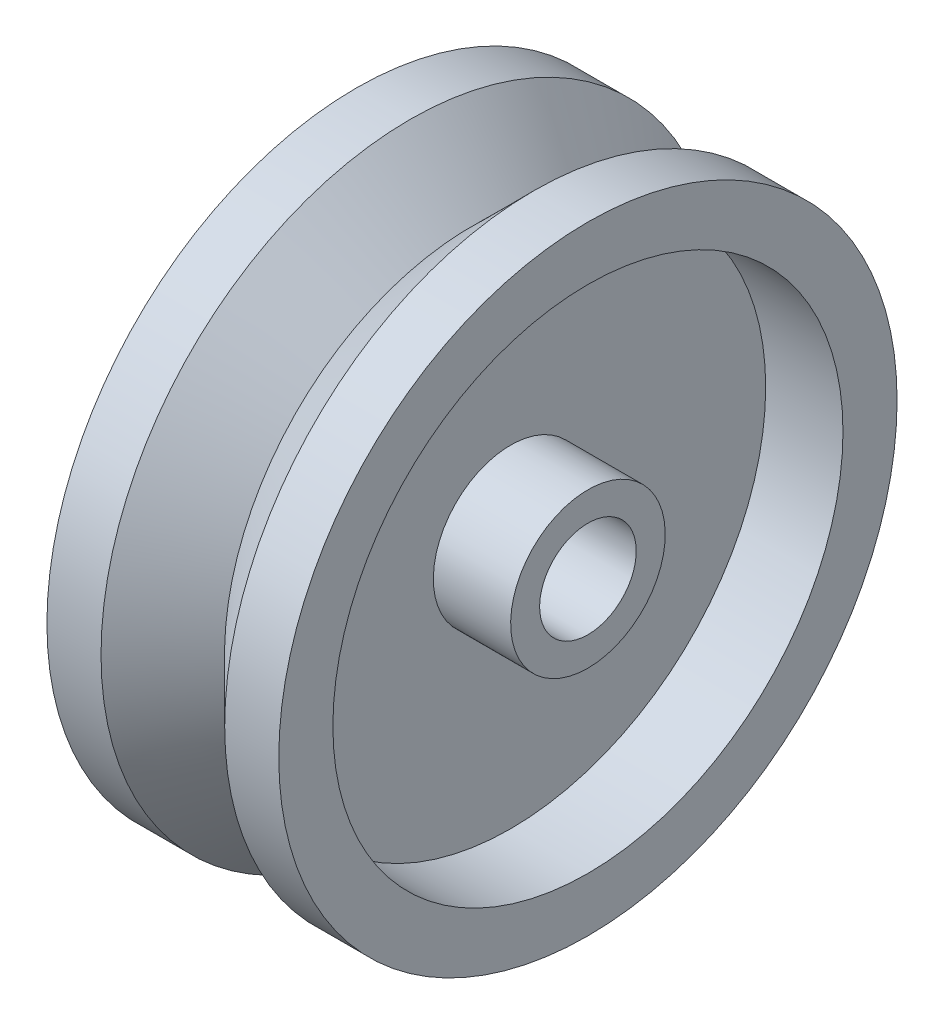
ISO-10303-21;
HEADER;
FILE_DESCRIPTION(('STEP AP214'),'2;1');
FILE_NAME('part.step','',(''),(''),'','','');
FILE_SCHEMA(('AUTOMOTIVE_DESIGN { 1 0 10303 214 1 1 1 1 }'));
ENDSEC;
DATA;
#1=APPLICATION_CONTEXT('core data for automotive mechanical design processes');
#2=APPLICATION_PROTOCOL_DEFINITION('international standard','automotive_design',2000,#1);
#3=PRODUCT_CONTEXT('',#1,'mechanical');
#4=PRODUCT('Part','Part','',(#3));
#5=PRODUCT_RELATED_PRODUCT_CATEGORY('part','',(#4));
#6=PRODUCT_DEFINITION_FORMATION('','',#4);
#7=PRODUCT_DEFINITION_CONTEXT('part definition',#1,'design');
#8=PRODUCT_DEFINITION('design','',#6,#7);
#9=PRODUCT_DEFINITION_SHAPE('','',#8);
#10=(LENGTH_UNIT() NAMED_UNIT(*) SI_UNIT(.MILLI.,.METRE.));
#11=(NAMED_UNIT(*) PLANE_ANGLE_UNIT() SI_UNIT($,.RADIAN.));
#12=(NAMED_UNIT(*) SI_UNIT($,.STERADIAN.) SOLID_ANGLE_UNIT());
#13=UNCERTAINTY_MEASURE_WITH_UNIT(LENGTH_MEASURE(1.E-05),#10,'distance_accuracy_value','');
#14=(GEOMETRIC_REPRESENTATION_CONTEXT(3) GLOBAL_UNCERTAINTY_ASSIGNED_CONTEXT((#13)) GLOBAL_UNIT_ASSIGNED_CONTEXT((#10,
#11,#12)) REPRESENTATION_CONTEXT('',''));
#15=CARTESIAN_POINT('',(0.,0.,0.));
#16=DIRECTION('',(0.,0.,1.));
#17=DIRECTION('',(1.,0.,0.));
#18=AXIS2_PLACEMENT_3D('',#15,#16,#17);
#19=CARTESIAN_POINT('',(7.5,-3.125,0.));
#20=DIRECTION('',(-1.,0.,0.));
#21=DIRECTION('',(0.,-1.,0.));
#22=AXIS2_PLACEMENT_3D('',#19,#20,#21);
#23=PLANE('',#22);
#24=CARTESIAN_POINT('',(7.5,0.,0.));
#25=DIRECTION('',(-1.,0.,0.));
#26=DIRECTION('',(0.,-1.,0.));
#27=AXIS2_PLACEMENT_3D('',#24,#25,#26);
#28=CIRCLE('',#27,5.);
#29=CARTESIAN_POINT('',(7.5,-5.,0.));
#30=VERTEX_POINT('',#29);
#31=EDGE_CURVE('E80',#30,#30,#28,.T.);
#32=ORIENTED_EDGE('',*,*,#31,.F.);
#33=EDGE_LOOP('',(#32));
#34=FACE_BOUND('',#33,.T.);
#35=CARTESIAN_POINT('',(7.5,0.,0.));
#36=DIRECTION('',(-1.,0.,0.));
#37=DIRECTION('',(0.,-1.,0.));
#38=AXIS2_PLACEMENT_3D('',#35,#36,#37);
#39=CIRCLE('',#38,3.125);
#40=CARTESIAN_POINT('',(7.5,-3.125,0.));
#41=VERTEX_POINT('',#40);
#42=EDGE_CURVE('E10',#41,#41,#39,.T.);
#43=ORIENTED_EDGE('',*,*,#42,.T.);
#44=EDGE_LOOP('',(#43));
#45=FACE_BOUND('',#44,.T.);
#46=ADVANCED_FACE('F31',(#34,#45),#23,.F.);
#47=CARTESIAN_POINT('',(-7.5,0.,0.));
#48=DIRECTION('',(-1.,0.,0.));
#49=DIRECTION('',(0.,-1.,0.));
#50=AXIS2_PLACEMENT_3D('',#47,#48,#49);
#51=CYLINDRICAL_SURFACE('',#50,3.125);
#52=ORIENTED_EDGE('',*,*,#42,.F.);
#53=EDGE_LOOP('',(#52));
#54=FACE_BOUND('',#53,.T.);
#55=CARTESIAN_POINT('',(-7.5,0.,0.));
#56=DIRECTION('',(-1.,0.,0.));
#57=DIRECTION('',(0.,-1.,0.));
#58=AXIS2_PLACEMENT_3D('',#55,#56,#57);
#59=CIRCLE('',#58,3.125);
#60=CARTESIAN_POINT('',(-7.5,-3.125,0.));
#61=VERTEX_POINT('',#60);
#62=EDGE_CURVE('E37',#61,#61,#59,.T.);
#63=ORIENTED_EDGE('',*,*,#62,.T.);
#64=EDGE_LOOP('',(#63));
#65=FACE_BOUND('',#64,.T.);
#66=ADVANCED_FACE('F87',(#54,#65),#51,.F.);
#67=CARTESIAN_POINT('',(-7.5,-3.125,0.));
#68=DIRECTION('',(1.,0.,0.));
#69=DIRECTION('',(0.,1.,0.));
#70=AXIS2_PLACEMENT_3D('',#67,#68,#69);
#71=PLANE('',#70);
#72=ORIENTED_EDGE('',*,*,#62,.F.);
#73=EDGE_LOOP('',(#72));
#74=FACE_BOUND('',#73,.T.);
#75=CARTESIAN_POINT('',(-7.5,0.,0.));
#76=DIRECTION('',(-1.,0.,0.));
#77=DIRECTION('',(0.,-1.,0.));
#78=AXIS2_PLACEMENT_3D('',#75,#76,#77);
#79=CIRCLE('',#78,5.);
#80=CARTESIAN_POINT('',(-7.5,-5.,0.));
#81=VERTEX_POINT('',#80);
#82=EDGE_CURVE('E41',#81,#81,#79,.T.);
#83=ORIENTED_EDGE('',*,*,#82,.T.);
#84=EDGE_LOOP('',(#83));
#85=FACE_BOUND('',#84,.T.);
#86=ADVANCED_FACE('F91',(#74,#85),#71,.F.);
#87=CARTESIAN_POINT('',(-7.5,0.,0.));
#88=DIRECTION('',(-1.,0.,0.));
#89=DIRECTION('',(0.,-1.,0.));
#90=AXIS2_PLACEMENT_3D('',#87,#88,#89);
#91=CYLINDRICAL_SURFACE('',#90,5.);
#92=ORIENTED_EDGE('',*,*,#82,.F.);
#93=EDGE_LOOP('',(#92));
#94=FACE_BOUND('',#93,.T.);
#95=CARTESIAN_POINT('',(-2.5,0.,0.));
#96=DIRECTION('',(-1.,0.,0.));
#97=DIRECTION('',(0.,-1.,0.));
#98=AXIS2_PLACEMENT_3D('',#95,#96,#97);
#99=CIRCLE('',#98,5.);
#100=CARTESIAN_POINT('',(-2.5,-5.,0.));
#101=VERTEX_POINT('',#100);
#102=EDGE_CURVE('E45',#101,#101,#99,.T.);
#103=ORIENTED_EDGE('',*,*,#102,.T.);
#104=EDGE_LOOP('',(#103));
#105=FACE_BOUND('',#104,.T.);
#106=ADVANCED_FACE('F96',(#94,#105),#91,.T.);
#107=CARTESIAN_POINT('',(-2.5,-5.,0.));
#108=DIRECTION('',(1.,0.,0.));
#109=DIRECTION('',(0.,1.,0.));
#110=AXIS2_PLACEMENT_3D('',#107,#108,#109);
#111=PLANE('',#110);
#112=ORIENTED_EDGE('',*,*,#102,.F.);
#113=EDGE_LOOP('',(#112));
#114=FACE_BOUND('',#113,.T.);
#115=CARTESIAN_POINT('',(-2.5,0.,0.));
#116=DIRECTION('',(-1.,0.,0.));
#117=DIRECTION('',(0.,-1.,0.));
#118=AXIS2_PLACEMENT_3D('',#115,#116,#117);
#119=CIRCLE('',#118,16.5);
#120=CARTESIAN_POINT('',(-2.49999999999999,-16.5,0.));
#121=VERTEX_POINT('',#120);
#122=EDGE_CURVE('E50',#121,#121,#119,.T.);
#123=ORIENTED_EDGE('',*,*,#122,.T.);
#124=EDGE_LOOP('',(#123));
#125=FACE_BOUND('',#124,.T.);
#126=ADVANCED_FACE('F102',(#114,#125),#111,.F.);
#127=CARTESIAN_POINT('',(-7.5,0.,0.));
#128=DIRECTION('',(-1.,0.,0.));
#129=DIRECTION('',(0.,-1.,0.));
#130=AXIS2_PLACEMENT_3D('',#127,#128,#129);
#131=CYLINDRICAL_SURFACE('',#130,16.5);
#132=ORIENTED_EDGE('',*,*,#122,.F.);
#133=EDGE_LOOP('',(#132));
#134=FACE_BOUND('',#133,.T.);
#135=CARTESIAN_POINT('',(-7.5,0.,0.));
#136=DIRECTION('',(-1.,0.,0.));
#137=DIRECTION('',(0.,-1.,0.));
#138=AXIS2_PLACEMENT_3D('',#135,#136,#137);
#139=CIRCLE('',#138,16.5);
#140=CARTESIAN_POINT('',(-7.49999999999999,-16.5,0.));
#141=VERTEX_POINT('',#140);
#142=EDGE_CURVE('E53',#141,#141,#139,.T.);
#143=ORIENTED_EDGE('',*,*,#142,.T.);
#144=EDGE_LOOP('',(#143));
#145=FACE_BOUND('',#144,.T.);
#146=ADVANCED_FACE('F106',(#134,#145),#131,.F.);
#147=CARTESIAN_POINT('',(-7.49999999999999,-16.5,1.15218884181823E-13));
#148=DIRECTION('',(1.,0.,0.));
#149=DIRECTION('',(0.,1.,0.));
#150=AXIS2_PLACEMENT_3D('',#147,#148,#149);
#151=PLANE('',#150);
#152=ORIENTED_EDGE('',*,*,#142,.F.);
#153=EDGE_LOOP('',(#152));
#154=FACE_BOUND('',#153,.T.);
#155=CARTESIAN_POINT('',(-7.5,0.,0.));
#156=DIRECTION('',(-1.,0.,0.));
#157=DIRECTION('',(0.,-1.,0.));
#158=AXIS2_PLACEMENT_3D('',#155,#156,#157);
#159=CIRCLE('',#158,20.);
#160=CARTESIAN_POINT('',(-7.49999999999999,-20.,0.));
#161=VERTEX_POINT('',#160);
#162=EDGE_CURVE('E56',#161,#161,#159,.T.);
#163=ORIENTED_EDGE('',*,*,#162,.T.);
#164=EDGE_LOOP('',(#163));
#165=FACE_BOUND('',#164,.T.);
#166=ADVANCED_FACE('F110',(#154,#165),#151,.F.);
#167=CARTESIAN_POINT('',(-7.5,0.,0.));
#168=DIRECTION('',(-1.,0.,0.));
#169=DIRECTION('',(0.,-1.,0.));
#170=AXIS2_PLACEMENT_3D('',#167,#168,#169);
#171=CYLINDRICAL_SURFACE('',#170,20.);
#172=ORIENTED_EDGE('',*,*,#162,.F.);
#173=EDGE_LOOP('',(#172));
#174=FACE_BOUND('',#173,.T.);
#175=CARTESIAN_POINT('',(-4.,0.,0.));
#176=DIRECTION('',(-1.,0.,0.));
#177=DIRECTION('',(0.,-1.,0.));
#178=AXIS2_PLACEMENT_3D('',#175,#176,#177);
#179=CIRCLE('',#178,20.);
#180=CARTESIAN_POINT('',(-3.99999999999999,-20.,0.));
#181=VERTEX_POINT('',#180);
#182=EDGE_CURVE('E59',#181,#181,#179,.T.);
#183=ORIENTED_EDGE('',*,*,#182,.T.);
#184=EDGE_LOOP('',(#183));
#185=FACE_BOUND('',#184,.T.);
#186=ADVANCED_FACE('F114',(#174,#185),#171,.T.);
#187=CARTESIAN_POINT('',(-0.0109956459332563,0.,0.));
#188=DIRECTION('',(-1.,0.,0.));
#189=DIRECTION('',(0.,-1.,0.));
#190=AXIS2_PLACEMENT_3D('',#187,#188,#189);
#191=CONICAL_SURFACE('',#190,16.0000151130573,0.786772620870126);
#192=ORIENTED_EDGE('',*,*,#182,.F.);
#193=EDGE_LOOP('',(#192));
#194=FACE_BOUND('',#193,.T.);
#195=CARTESIAN_POINT('',(-0.0109956459332563,0.,0.));
#196=DIRECTION('',(-1.,0.,0.));
#197=DIRECTION('',(0.,-1.,0.));
#198=AXIS2_PLACEMENT_3D('',#195,#196,#197);
#199=CIRCLE('',#198,16.0000151130573);
#200=CARTESIAN_POINT('',(-0.0109956459332534,-16.0000151130573,0.));
#201=VERTEX_POINT('',#200);
#202=EDGE_CURVE('E62',#201,#201,#199,.T.);
#203=ORIENTED_EDGE('',*,*,#202,.T.);
#204=EDGE_LOOP('',(#203));
#205=FACE_BOUND('',#204,.T.);
#206=ADVANCED_FACE('F118',(#194,#205),#191,.T.);
#207=CARTESIAN_POINT('',(4.,0.,0.));
#208=DIRECTION('',(1.,0.,0.));
#209=DIRECTION('',(0.,1.,0.));
#210=AXIS2_PLACEMENT_3D('',#207,#208,#209);
#211=CONICAL_SURFACE('',#210,20.,0.784023705924768);
#212=ORIENTED_EDGE('',*,*,#202,.F.);
#213=EDGE_LOOP('',(#212));
#214=FACE_BOUND('',#213,.T.);
#215=CARTESIAN_POINT('',(4.,0.,0.));
#216=DIRECTION('',(-1.,0.,0.));
#217=DIRECTION('',(0.,-1.,0.));
#218=AXIS2_PLACEMENT_3D('',#215,#216,#217);
#219=CIRCLE('',#218,20.);
#220=CARTESIAN_POINT('',(4.00000000000001,-20.,0.));
#221=VERTEX_POINT('',#220);
#222=EDGE_CURVE('E65',#221,#221,#219,.T.);
#223=ORIENTED_EDGE('',*,*,#222,.T.);
#224=EDGE_LOOP('',(#223));
#225=FACE_BOUND('',#224,.T.);
#226=ADVANCED_FACE('F122',(#214,#225),#211,.T.);
#227=CARTESIAN_POINT('',(-7.5,0.,0.));
#228=DIRECTION('',(-1.,0.,0.));
#229=DIRECTION('',(0.,-1.,0.));
#230=AXIS2_PLACEMENT_3D('',#227,#228,#229);
#231=CYLINDRICAL_SURFACE('',#230,20.);
#232=ORIENTED_EDGE('',*,*,#222,.F.);
#233=EDGE_LOOP('',(#232));
#234=FACE_BOUND('',#233,.T.);
#235=CARTESIAN_POINT('',(7.5,0.,0.));
#236=DIRECTION('',(-1.,0.,0.));
#237=DIRECTION('',(0.,-1.,0.));
#238=AXIS2_PLACEMENT_3D('',#235,#236,#237);
#239=CIRCLE('',#238,20.);
#240=CARTESIAN_POINT('',(7.50000000000001,-20.,0.));
#241=VERTEX_POINT('',#240);
#242=EDGE_CURVE('E68',#241,#241,#239,.T.);
#243=ORIENTED_EDGE('',*,*,#242,.T.);
#244=EDGE_LOOP('',(#243));
#245=FACE_BOUND('',#244,.T.);
#246=ADVANCED_FACE('F126',(#234,#245),#231,.T.);
#247=CARTESIAN_POINT('',(7.50000000000001,-20.,1.39659253553725E-13));
#248=DIRECTION('',(-1.,0.,0.));
#249=DIRECTION('',(0.,-1.,0.));
#250=AXIS2_PLACEMENT_3D('',#247,#248,#249);
#251=PLANE('',#250);
#252=ORIENTED_EDGE('',*,*,#242,.F.);
#253=EDGE_LOOP('',(#252));
#254=FACE_BOUND('',#253,.T.);
#255=CARTESIAN_POINT('',(7.5,0.,0.));
#256=DIRECTION('',(-1.,0.,0.));
#257=DIRECTION('',(0.,-1.,0.));
#258=AXIS2_PLACEMENT_3D('',#255,#256,#257);
#259=CIRCLE('',#258,16.5);
#260=CARTESIAN_POINT('',(7.50000000000001,-16.5,0.));
#261=VERTEX_POINT('',#260);
#262=EDGE_CURVE('E71',#261,#261,#259,.T.);
#263=ORIENTED_EDGE('',*,*,#262,.T.);
#264=EDGE_LOOP('',(#263));
#265=FACE_BOUND('',#264,.T.);
#266=ADVANCED_FACE('F130',(#254,#265),#251,.F.);
#267=CARTESIAN_POINT('',(-7.5,0.,0.));
#268=DIRECTION('',(-1.,0.,0.));
#269=DIRECTION('',(0.,-1.,0.));
#270=AXIS2_PLACEMENT_3D('',#267,#268,#269);
#271=CYLINDRICAL_SURFACE('',#270,16.5);
#272=ORIENTED_EDGE('',*,*,#262,.F.);
#273=EDGE_LOOP('',(#272));
#274=FACE_BOUND('',#273,.T.);
#275=CARTESIAN_POINT('',(2.5,0.,0.));
#276=DIRECTION('',(-1.,0.,0.));
#277=DIRECTION('',(0.,-1.,0.));
#278=AXIS2_PLACEMENT_3D('',#275,#276,#277);
#279=CIRCLE('',#278,16.5);
#280=CARTESIAN_POINT('',(2.50000000000001,-16.5,0.));
#281=VERTEX_POINT('',#280);
#282=EDGE_CURVE('E74',#281,#281,#279,.T.);
#283=ORIENTED_EDGE('',*,*,#282,.T.);
#284=EDGE_LOOP('',(#283));
#285=FACE_BOUND('',#284,.T.);
#286=ADVANCED_FACE('F134',(#274,#285),#271,.F.);
#287=CARTESIAN_POINT('',(2.5,-5.,0.));
#288=DIRECTION('',(-1.,0.,0.));
#289=DIRECTION('',(0.,-1.,0.));
#290=AXIS2_PLACEMENT_3D('',#287,#288,#289);
#291=PLANE('',#290);
#292=ORIENTED_EDGE('',*,*,#282,.F.);
#293=EDGE_LOOP('',(#292));
#294=FACE_BOUND('',#293,.T.);
#295=CARTESIAN_POINT('',(2.5,0.,0.));
#296=DIRECTION('',(-1.,0.,0.));
#297=DIRECTION('',(0.,-1.,0.));
#298=AXIS2_PLACEMENT_3D('',#295,#296,#297);
#299=CIRCLE('',#298,5.);
#300=CARTESIAN_POINT('',(2.5,-5.,0.));
#301=VERTEX_POINT('',#300);
#302=EDGE_CURVE('E77',#301,#301,#299,.T.);
#303=ORIENTED_EDGE('',*,*,#302,.T.);
#304=EDGE_LOOP('',(#303));
#305=FACE_BOUND('',#304,.T.);
#306=ADVANCED_FACE('F138',(#294,#305),#291,.F.);
#307=CARTESIAN_POINT('',(-7.5,0.,0.));
#308=DIRECTION('',(-1.,0.,0.));
#309=DIRECTION('',(0.,-1.,0.));
#310=AXIS2_PLACEMENT_3D('',#307,#308,#309);
#311=CYLINDRICAL_SURFACE('',#310,5.);
#312=ORIENTED_EDGE('',*,*,#302,.F.);
#313=EDGE_LOOP('',(#312));
#314=FACE_BOUND('',#313,.T.);
#315=ORIENTED_EDGE('',*,*,#31,.T.);
#316=EDGE_LOOP('',(#315));
#317=FACE_BOUND('',#316,.T.);
#318=ADVANCED_FACE('F84',(#314,#317),#311,.T.);
#319=CLOSED_SHELL('',(#46,#66,#86,#106,#126,#146,#166,#186,#206,#226,#246,#266,#286,#306,#318));
#320=MANIFOLD_SOLID_BREP('B2',#319);
#321=ADVANCED_BREP_SHAPE_REPRESENTATION('',(#18,#320),#14);
#322=SHAPE_DEFINITION_REPRESENTATION(#9,#321);
ENDSEC;
END-ISO-10303-21;
